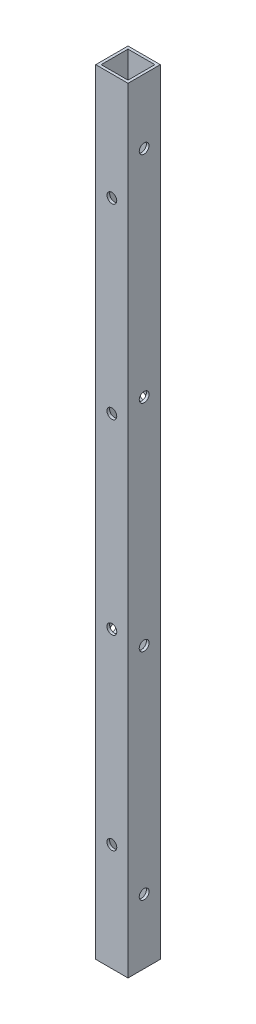
ISO-10303-21;
HEADER;
FILE_DESCRIPTION(('STEP AP214'),'2;1');
FILE_NAME('part.step','',(''),(''),'','','');
FILE_SCHEMA(('AUTOMOTIVE_DESIGN { 1 0 10303 214 1 1 1 1 }'));
ENDSEC;
DATA;
#1=APPLICATION_CONTEXT('core data for automotive mechanical design processes');
#2=APPLICATION_PROTOCOL_DEFINITION('international standard','automotive_design',2000,#1);
#3=PRODUCT_CONTEXT('',#1,'mechanical');
#4=PRODUCT('Part','Part','',(#3));
#5=PRODUCT_RELATED_PRODUCT_CATEGORY('part','',(#4));
#6=PRODUCT_DEFINITION_FORMATION('','',#4);
#7=PRODUCT_DEFINITION_CONTEXT('part definition',#1,'design');
#8=PRODUCT_DEFINITION('design','',#6,#7);
#9=PRODUCT_DEFINITION_SHAPE('','',#8);
#10=(LENGTH_UNIT() NAMED_UNIT(*) SI_UNIT(.MILLI.,.METRE.));
#11=(NAMED_UNIT(*) PLANE_ANGLE_UNIT() SI_UNIT($,.RADIAN.));
#12=(NAMED_UNIT(*) SI_UNIT($,.STERADIAN.) SOLID_ANGLE_UNIT());
#13=UNCERTAINTY_MEASURE_WITH_UNIT(LENGTH_MEASURE(1.E-05),#10,'distance_accuracy_value','');
#14=(GEOMETRIC_REPRESENTATION_CONTEXT(3) GLOBAL_UNCERTAINTY_ASSIGNED_CONTEXT((#13)) GLOBAL_UNIT_ASSIGNED_CONTEXT((#10,
#11,#12)) REPRESENTATION_CONTEXT('',''));
#15=CARTESIAN_POINT('',(0.,0.,0.));
#16=DIRECTION('',(0.,0.,1.));
#17=DIRECTION('',(1.,0.,0.));
#18=AXIS2_PLACEMENT_3D('',#15,#16,#17);
#19=CARTESIAN_POINT('',(9.52500000000001,38.0999999999999,0.));
#20=DIRECTION('',(-1.,0.,0.));
#21=DIRECTION('',(0.,0.,1.));
#22=AXIS2_PLACEMENT_3D('',#19,#20,#21);
#23=CYLINDRICAL_SURFACE('',#22,2.8956);
#24=CARTESIAN_POINT('',(-7.9375,38.0999999999999,0.));
#25=DIRECTION('',(1.,0.,0.));
#26=DIRECTION('',(0.,0.,-1.));
#27=AXIS2_PLACEMENT_3D('',#24,#25,#26);
#28=CIRCLE('',#27,2.8956);
#29=CARTESIAN_POINT('',(-7.9375,38.0999999999999,-2.8956));
#30=VERTEX_POINT('',#29);
#31=EDGE_CURVE('E40',#30,#30,#28,.T.);
#32=ORIENTED_EDGE('',*,*,#31,.T.);
#33=EDGE_LOOP('',(#32));
#34=FACE_BOUND('',#33,.T.);
#35=CARTESIAN_POINT('',(-9.525,38.0999999999999,0.));
#36=DIRECTION('',(-1.,0.,0.));
#37=DIRECTION('',(0.,0.,1.));
#38=AXIS2_PLACEMENT_3D('',#35,#36,#37);
#39=CIRCLE('',#38,2.8956);
#40=CARTESIAN_POINT('',(-9.525,38.0999999999999,2.89560000000001));
#41=VERTEX_POINT('',#40);
#42=EDGE_CURVE('E11',#41,#41,#39,.T.);
#43=ORIENTED_EDGE('',*,*,#42,.T.);
#44=EDGE_LOOP('',(#43));
#45=FACE_BOUND('',#44,.T.);
#46=ADVANCED_FACE('F33',(#34,#45),#23,.F.);
#47=CARTESIAN_POINT('',(9.52500000000001,165.167733333333,0.));
#48=DIRECTION('',(-1.,0.,0.));
#49=DIRECTION('',(0.,0.,1.));
#50=AXIS2_PLACEMENT_3D('',#47,#48,#49);
#51=CYLINDRICAL_SURFACE('',#50,2.8956);
#52=CARTESIAN_POINT('',(-7.9375,165.167733333333,0.));
#53=DIRECTION('',(1.,0.,0.));
#54=DIRECTION('',(0.,0.,-1.));
#55=AXIS2_PLACEMENT_3D('',#52,#53,#54);
#56=CIRCLE('',#55,2.8956);
#57=CARTESIAN_POINT('',(-7.9375,165.167733333333,-2.8956));
#58=VERTEX_POINT('',#57);
#59=EDGE_CURVE('E212',#58,#58,#56,.T.);
#60=ORIENTED_EDGE('',*,*,#59,.T.);
#61=EDGE_LOOP('',(#60));
#62=FACE_BOUND('',#61,.T.);
#63=CARTESIAN_POINT('',(-9.525,165.167733333333,0.));
#64=DIRECTION('',(-1.,0.,0.));
#65=DIRECTION('',(0.,0.,1.));
#66=AXIS2_PLACEMENT_3D('',#63,#64,#65);
#67=CIRCLE('',#66,2.8956);
#68=CARTESIAN_POINT('',(-9.525,165.167733333333,2.89560000000001));
#69=VERTEX_POINT('',#68);
#70=EDGE_CURVE('E215',#69,#69,#67,.T.);
#71=ORIENTED_EDGE('',*,*,#70,.T.);
#72=EDGE_LOOP('',(#71));
#73=FACE_BOUND('',#72,.T.);
#74=ADVANCED_FACE('F239',(#62,#73),#51,.F.);
#75=CARTESIAN_POINT('',(9.52500000000001,38.0999999999999,0.));
#76=DIRECTION('',(-1.,0.,0.));
#77=DIRECTION('',(0.,0.,1.));
#78=AXIS2_PLACEMENT_3D('',#75,#76,#77);
#79=CYLINDRICAL_SURFACE('',#78,2.8956);
#80=CARTESIAN_POINT('',(7.9375,38.0999999999999,0.));
#81=DIRECTION('',(-1.,0.,0.));
#82=DIRECTION('',(0.,0.,1.));
#83=AXIS2_PLACEMENT_3D('',#80,#81,#82);
#84=CIRCLE('',#83,2.8956);
#85=CARTESIAN_POINT('',(7.9375,38.0999999999999,2.8956));
#86=VERTEX_POINT('',#85);
#87=EDGE_CURVE('E206',#86,#86,#84,.T.);
#88=ORIENTED_EDGE('',*,*,#87,.T.);
#89=EDGE_LOOP('',(#88));
#90=FACE_BOUND('',#89,.T.);
#91=CARTESIAN_POINT('',(9.52500000000001,38.0999999999999,0.));
#92=DIRECTION('',(-1.,0.,0.));
#93=DIRECTION('',(0.,0.,1.));
#94=AXIS2_PLACEMENT_3D('',#91,#92,#93);
#95=CIRCLE('',#94,2.8956);
#96=CARTESIAN_POINT('',(9.52500000000001,38.0999999999999,2.8956));
#97=VERTEX_POINT('',#96);
#98=EDGE_CURVE('E209',#97,#97,#95,.T.);
#99=ORIENTED_EDGE('',*,*,#98,.F.);
#100=EDGE_LOOP('',(#99));
#101=FACE_BOUND('',#100,.T.);
#102=ADVANCED_FACE('F243',(#90,#101),#79,.F.);
#103=CARTESIAN_POINT('',(9.52500000000001,165.167733333333,0.));
#104=DIRECTION('',(-1.,0.,0.));
#105=DIRECTION('',(0.,0.,1.));
#106=AXIS2_PLACEMENT_3D('',#103,#104,#105);
#107=CYLINDRICAL_SURFACE('',#106,2.8956);
#108=CARTESIAN_POINT('',(7.9375,165.167733333333,0.));
#109=DIRECTION('',(-1.,0.,0.));
#110=DIRECTION('',(0.,0.,1.));
#111=AXIS2_PLACEMENT_3D('',#108,#109,#110);
#112=CIRCLE('',#111,2.8956);
#113=CARTESIAN_POINT('',(7.9375,165.167733333333,2.8956));
#114=VERTEX_POINT('',#113);
#115=EDGE_CURVE('E195',#114,#114,#112,.T.);
#116=ORIENTED_EDGE('',*,*,#115,.T.);
#117=EDGE_LOOP('',(#116));
#118=FACE_BOUND('',#117,.T.);
#119=CARTESIAN_POINT('',(9.52500000000001,165.167733333333,0.));
#120=DIRECTION('',(-1.,0.,0.));
#121=DIRECTION('',(0.,0.,1.));
#122=AXIS2_PLACEMENT_3D('',#119,#120,#121);
#123=CIRCLE('',#122,2.8956);
#124=CARTESIAN_POINT('',(9.52500000000001,165.167733333333,2.8956));
#125=VERTEX_POINT('',#124);
#126=EDGE_CURVE('E203',#125,#125,#123,.T.);
#127=ORIENTED_EDGE('',*,*,#126,.F.);
#128=EDGE_LOOP('',(#127));
#129=FACE_BOUND('',#128,.T.);
#130=ADVANCED_FACE('F248',(#118,#129),#107,.F.);
#131=CARTESIAN_POINT('',(0.,63.3984,-9.525));
#132=DIRECTION('',(0.,0.,1.));
#133=DIRECTION('',(1.,0.,0.));
#134=AXIS2_PLACEMENT_3D('',#131,#132,#133);
#135=CYLINDRICAL_SURFACE('',#134,2.8956);
#136=CARTESIAN_POINT('',(0.,63.3984,7.9375));
#137=DIRECTION('',(0.,0.,-1.));
#138=DIRECTION('',(-1.,0.,0.));
#139=AXIS2_PLACEMENT_3D('',#136,#137,#138);
#140=CIRCLE('',#139,2.8956);
#141=CARTESIAN_POINT('',(-2.8956,63.3984,7.9375));
#142=VERTEX_POINT('',#141);
#143=EDGE_CURVE('E189',#142,#142,#140,.T.);
#144=ORIENTED_EDGE('',*,*,#143,.T.);
#145=EDGE_LOOP('',(#144));
#146=FACE_BOUND('',#145,.T.);
#147=CARTESIAN_POINT('',(0.,63.3984,9.525));
#148=DIRECTION('',(0.,0.,1.));
#149=DIRECTION('',(1.,0.,0.));
#150=AXIS2_PLACEMENT_3D('',#147,#148,#149);
#151=CIRCLE('',#150,2.8956);
#152=CARTESIAN_POINT('',(2.8956,63.3984,9.525));
#153=VERTEX_POINT('',#152);
#154=EDGE_CURVE('E192',#153,#153,#151,.T.);
#155=ORIENTED_EDGE('',*,*,#154,.T.);
#156=EDGE_LOOP('',(#155));
#157=FACE_BOUND('',#156,.T.);
#158=ADVANCED_FACE('F255',(#146,#157),#135,.F.);
#159=CARTESIAN_POINT('',(0.,173.600533333333,-9.525));
#160=DIRECTION('',(0.,0.,1.));
#161=DIRECTION('',(1.,0.,0.));
#162=AXIS2_PLACEMENT_3D('',#159,#160,#161);
#163=CYLINDRICAL_SURFACE('',#162,2.8956);
#164=CARTESIAN_POINT('',(0.,173.600533333333,7.9375));
#165=DIRECTION('',(0.,0.,-1.));
#166=DIRECTION('',(-1.,0.,0.));
#167=AXIS2_PLACEMENT_3D('',#164,#165,#166);
#168=CIRCLE('',#167,2.8956);
#169=CARTESIAN_POINT('',(-2.8956,173.600533333333,7.9375));
#170=VERTEX_POINT('',#169);
#171=EDGE_CURVE('E183',#170,#170,#168,.T.);
#172=ORIENTED_EDGE('',*,*,#171,.T.);
#173=EDGE_LOOP('',(#172));
#174=FACE_BOUND('',#173,.T.);
#175=CARTESIAN_POINT('',(0.,173.600533333333,9.525));
#176=DIRECTION('',(0.,0.,1.));
#177=DIRECTION('',(1.,0.,0.));
#178=AXIS2_PLACEMENT_3D('',#175,#176,#177);
#179=CIRCLE('',#178,2.8956);
#180=CARTESIAN_POINT('',(2.8956,173.600533333333,9.525));
#181=VERTEX_POINT('',#180);
#182=EDGE_CURVE('E186',#181,#181,#179,.T.);
#183=ORIENTED_EDGE('',*,*,#182,.T.);
#184=EDGE_LOOP('',(#183));
#185=FACE_BOUND('',#184,.T.);
#186=ADVANCED_FACE('F259',(#174,#185),#163,.F.);
#187=CARTESIAN_POINT('',(0.,63.3984,-9.525));
#188=DIRECTION('',(0.,0.,1.));
#189=DIRECTION('',(1.,0.,0.));
#190=AXIS2_PLACEMENT_3D('',#187,#188,#189);
#191=CYLINDRICAL_SURFACE('',#190,2.8956);
#192=CARTESIAN_POINT('',(0.,63.3984,-7.9375));
#193=DIRECTION('',(0.,0.,1.));
#194=DIRECTION('',(1.,0.,0.));
#195=AXIS2_PLACEMENT_3D('',#192,#193,#194);
#196=CIRCLE('',#195,2.8956);
#197=CARTESIAN_POINT('',(2.8956,63.3984,-7.9375));
#198=VERTEX_POINT('',#197);
#199=EDGE_CURVE('E177',#198,#198,#196,.T.);
#200=ORIENTED_EDGE('',*,*,#199,.T.);
#201=EDGE_LOOP('',(#200));
#202=FACE_BOUND('',#201,.T.);
#203=CARTESIAN_POINT('',(0.,63.3984,-9.525));
#204=DIRECTION('',(0.,0.,1.));
#205=DIRECTION('',(1.,0.,0.));
#206=AXIS2_PLACEMENT_3D('',#203,#204,#205);
#207=CIRCLE('',#206,2.8956);
#208=CARTESIAN_POINT('',(2.8956,63.3984,-9.525));
#209=VERTEX_POINT('',#208);
#210=EDGE_CURVE('E180',#209,#209,#207,.T.);
#211=ORIENTED_EDGE('',*,*,#210,.F.);
#212=EDGE_LOOP('',(#211));
#213=FACE_BOUND('',#212,.T.);
#214=ADVANCED_FACE('F263',(#202,#213),#191,.F.);
#215=CARTESIAN_POINT('',(0.,173.600533333333,-9.525));
#216=DIRECTION('',(0.,0.,1.));
#217=DIRECTION('',(1.,0.,0.));
#218=AXIS2_PLACEMENT_3D('',#215,#216,#217);
#219=CYLINDRICAL_SURFACE('',#218,2.8956);
#220=CARTESIAN_POINT('',(0.,173.600533333333,-7.9375));
#221=DIRECTION('',(0.,0.,1.));
#222=DIRECTION('',(1.,0.,0.));
#223=AXIS2_PLACEMENT_3D('',#220,#221,#222);
#224=CIRCLE('',#223,2.8956);
#225=CARTESIAN_POINT('',(2.8956,173.600533333333,-7.9375));
#226=VERTEX_POINT('',#225);
#227=EDGE_CURVE('E167',#226,#226,#224,.T.);
#228=ORIENTED_EDGE('',*,*,#227,.T.);
#229=EDGE_LOOP('',(#228));
#230=FACE_BOUND('',#229,.T.);
#231=CARTESIAN_POINT('',(0.,173.600533333333,-9.525));
#232=DIRECTION('',(0.,0.,1.));
#233=DIRECTION('',(1.,0.,0.));
#234=AXIS2_PLACEMENT_3D('',#231,#232,#233);
#235=CIRCLE('',#234,2.8956);
#236=CARTESIAN_POINT('',(2.8956,173.600533333333,-9.525));
#237=VERTEX_POINT('',#236);
#238=EDGE_CURVE('E174',#237,#237,#235,.T.);
#239=ORIENTED_EDGE('',*,*,#238,.F.);
#240=EDGE_LOOP('',(#239));
#241=FACE_BOUND('',#240,.T.);
#242=ADVANCED_FACE('F267',(#230,#241),#219,.F.);
#243=CARTESIAN_POINT('',(0.,457.4032,0.));
#244=DIRECTION('',(0.,1.,0.));
#245=DIRECTION('',(0.,0.,1.));
#246=AXIS2_PLACEMENT_3D('',#243,#244,#245);
#247=PLANE('',#246);
#248=DIRECTION('',(0.,0.,-1.));
#249=VECTOR('',#248,1.);
#250=CARTESIAN_POINT('',(9.525,457.4032,-9.525));
#251=LINE('',#250,#249);
#252=CARTESIAN_POINT('',(9.525,457.4032,9.525));
#253=VERTEX_POINT('',#252);
#254=CARTESIAN_POINT('',(9.525,457.4032,-9.525));
#255=VERTEX_POINT('',#254);
#256=EDGE_CURVE('E138',#253,#255,#251,.T.);
#257=ORIENTED_EDGE('',*,*,#256,.T.);
#258=DIRECTION('',(-1.,0.,0.));
#259=VECTOR('',#258,1.);
#260=CARTESIAN_POINT('',(-9.525,457.4032,-9.525));
#261=LINE('',#260,#259);
#262=CARTESIAN_POINT('',(-9.525,457.4032,-9.525));
#263=VERTEX_POINT('',#262);
#264=EDGE_CURVE('E141',#255,#263,#261,.T.);
#265=ORIENTED_EDGE('',*,*,#264,.T.);
#266=DIRECTION('',(0.,0.,1.));
#267=VECTOR('',#266,1.);
#268=CARTESIAN_POINT('',(-9.525,457.4032,-9.525));
#269=LINE('',#268,#267);
#270=CARTESIAN_POINT('',(-9.525,457.4032,9.525));
#271=VERTEX_POINT('',#270);
#272=EDGE_CURVE('E144',#263,#271,#269,.T.);
#273=ORIENTED_EDGE('',*,*,#272,.T.);
#274=DIRECTION('',(1.,0.,0.));
#275=VECTOR('',#274,1.);
#276=CARTESIAN_POINT('',(-9.525,457.4032,9.525));
#277=LINE('',#276,#275);
#278=EDGE_CURVE('E146',#271,#253,#277,.T.);
#279=ORIENTED_EDGE('',*,*,#278,.T.);
#280=EDGE_LOOP('',(#257,#265,#273,#279));
#281=FACE_BOUND('',#280,.T.);
#282=DIRECTION('',(-1.,0.,0.));
#283=VECTOR('',#282,1.);
#284=CARTESIAN_POINT('',(-7.9375,457.4032,-7.9375));
#285=LINE('',#284,#283);
#286=CARTESIAN_POINT('',(7.9375,457.4032,-7.9375));
#287=VERTEX_POINT('',#286);
#288=CARTESIAN_POINT('',(-7.9375,457.4032,-7.9375));
#289=VERTEX_POINT('',#288);
#290=EDGE_CURVE('E106',#287,#289,#285,.T.);
#291=ORIENTED_EDGE('',*,*,#290,.F.);
#292=DIRECTION('',(0.,0.,-1.));
#293=VECTOR('',#292,1.);
#294=CARTESIAN_POINT('',(7.9375,457.4032,-7.9375));
#295=LINE('',#294,#293);
#296=CARTESIAN_POINT('',(7.9375,457.4032,7.9375));
#297=VERTEX_POINT('',#296);
#298=EDGE_CURVE('E97',#297,#287,#295,.T.);
#299=ORIENTED_EDGE('',*,*,#298,.F.);
#300=DIRECTION('',(1.,0.,0.));
#301=VECTOR('',#300,1.);
#302=CARTESIAN_POINT('',(-7.9375,457.4032,7.9375));
#303=LINE('',#302,#301);
#304=CARTESIAN_POINT('',(-7.9375,457.4032,7.9375));
#305=VERTEX_POINT('',#304);
#306=EDGE_CURVE('E122',#305,#297,#303,.T.);
#307=ORIENTED_EDGE('',*,*,#306,.F.);
#308=DIRECTION('',(0.,0.,1.));
#309=VECTOR('',#308,1.);
#310=CARTESIAN_POINT('',(-7.9375,457.4032,-7.9375));
#311=LINE('',#310,#309);
#312=EDGE_CURVE('E120',#289,#305,#311,.T.);
#313=ORIENTED_EDGE('',*,*,#312,.F.);
#314=EDGE_LOOP('',(#291,#299,#307,#313));
#315=FACE_BOUND('',#314,.T.);
#316=ADVANCED_FACE('F119',(#281,#315),#247,.T.);
#317=CARTESIAN_POINT('',(0.,0.,0.));
#318=DIRECTION('',(0.,1.,0.));
#319=DIRECTION('',(0.,0.,1.));
#320=AXIS2_PLACEMENT_3D('',#317,#318,#319);
#321=PLANE('',#320);
#322=DIRECTION('',(0.,0.,-1.));
#323=VECTOR('',#322,1.);
#324=CARTESIAN_POINT('',(9.525,0.,-9.525));
#325=LINE('',#324,#323);
#326=CARTESIAN_POINT('',(9.525,0.,9.525));
#327=VERTEX_POINT('',#326);
#328=CARTESIAN_POINT('',(9.525,0.,-9.525));
#329=VERTEX_POINT('',#328);
#330=EDGE_CURVE('E115',#327,#329,#325,.T.);
#331=ORIENTED_EDGE('',*,*,#330,.F.);
#332=DIRECTION('',(1.,0.,0.));
#333=VECTOR('',#332,1.);
#334=CARTESIAN_POINT('',(-9.525,0.,9.525));
#335=LINE('',#334,#333);
#336=CARTESIAN_POINT('',(-9.525,0.,9.525));
#337=VERTEX_POINT('',#336);
#338=EDGE_CURVE('E142',#337,#327,#335,.T.);
#339=ORIENTED_EDGE('',*,*,#338,.F.);
#340=DIRECTION('',(0.,0.,1.));
#341=VECTOR('',#340,1.);
#342=CARTESIAN_POINT('',(-9.525,0.,-9.525));
#343=LINE('',#342,#341);
#344=CARTESIAN_POINT('',(-9.525,0.,-9.525));
#345=VERTEX_POINT('',#344);
#346=EDGE_CURVE('E153',#345,#337,#343,.T.);
#347=ORIENTED_EDGE('',*,*,#346,.F.);
#348=DIRECTION('',(-1.,0.,0.));
#349=VECTOR('',#348,1.);
#350=CARTESIAN_POINT('',(-9.525,0.,-9.525));
#351=LINE('',#350,#349);
#352=EDGE_CURVE('E151',#329,#345,#351,.T.);
#353=ORIENTED_EDGE('',*,*,#352,.F.);
#354=EDGE_LOOP('',(#331,#339,#347,#353));
#355=FACE_BOUND('',#354,.T.);
#356=DIRECTION('',(0.,0.,-1.));
#357=VECTOR('',#356,1.);
#358=CARTESIAN_POINT('',(7.9375,0.,-7.9375));
#359=LINE('',#358,#357);
#360=CARTESIAN_POINT('',(7.9375,0.,7.9375));
#361=VERTEX_POINT('',#360);
#362=CARTESIAN_POINT('',(7.9375,0.,-7.9375));
#363=VERTEX_POINT('',#362);
#364=EDGE_CURVE('E55',#361,#363,#359,.T.);
#365=ORIENTED_EDGE('',*,*,#364,.T.);
#366=DIRECTION('',(-1.,0.,0.));
#367=VECTOR('',#366,1.);
#368=CARTESIAN_POINT('',(-7.9375,0.,-7.9375));
#369=LINE('',#368,#367);
#370=CARTESIAN_POINT('',(-7.9375,0.,-7.9375));
#371=VERTEX_POINT('',#370);
#372=EDGE_CURVE('E114',#363,#371,#369,.T.);
#373=ORIENTED_EDGE('',*,*,#372,.T.);
#374=DIRECTION('',(0.,0.,1.));
#375=VECTOR('',#374,1.);
#376=CARTESIAN_POINT('',(-7.9375,0.,-7.9375));
#377=LINE('',#376,#375);
#378=CARTESIAN_POINT('',(-7.9375,0.,7.9375));
#379=VERTEX_POINT('',#378);
#380=EDGE_CURVE('E130',#371,#379,#377,.T.);
#381=ORIENTED_EDGE('',*,*,#380,.T.);
#382=DIRECTION('',(1.,0.,0.));
#383=VECTOR('',#382,1.);
#384=CARTESIAN_POINT('',(-7.9375,0.,7.9375));
#385=LINE('',#384,#383);
#386=EDGE_CURVE('E107',#379,#361,#385,.T.);
#387=ORIENTED_EDGE('',*,*,#386,.T.);
#388=EDGE_LOOP('',(#365,#373,#381,#387));
#389=FACE_BOUND('',#388,.T.);
#390=ADVANCED_FACE('F276',(#355,#389),#321,.F.);
#391=CARTESIAN_POINT('',(9.525,457.4032,-9.525));
#392=DIRECTION('',(-1.,0.,0.));
#393=DIRECTION('',(0.,0.,1.));
#394=AXIS2_PLACEMENT_3D('',#391,#392,#393);
#395=PLANE('',#394);
#396=CARTESIAN_POINT('',(9.52500000000001,292.235466666667,0.));
#397=DIRECTION('',(-1.,0.,0.));
#398=DIRECTION('',(0.,0.,1.));
#399=AXIS2_PLACEMENT_3D('',#396,#397,#398);
#400=CIRCLE('',#399,2.8956);
#401=CARTESIAN_POINT('',(9.52500000000001,292.235466666667,2.8956));
#402=VERTEX_POINT('',#401);
#403=EDGE_CURVE('E416',#402,#402,#400,.T.);
#404=ORIENTED_EDGE('',*,*,#403,.T.);
#405=EDGE_LOOP('',(#404));
#406=FACE_BOUND('',#405,.T.);
#407=CARTESIAN_POINT('',(9.52500000000001,419.3032,0.));
#408=DIRECTION('',(-1.,0.,0.));
#409=DIRECTION('',(0.,0.,1.));
#410=AXIS2_PLACEMENT_3D('',#407,#408,#409);
#411=CIRCLE('',#410,2.8956);
#412=CARTESIAN_POINT('',(9.52500000000001,419.3032,2.8956));
#413=VERTEX_POINT('',#412);
#414=EDGE_CURVE('E200',#413,#413,#411,.T.);
#415=ORIENTED_EDGE('',*,*,#414,.T.);
#416=EDGE_LOOP('',(#415));
#417=FACE_BOUND('',#416,.T.);
#418=ORIENTED_EDGE('',*,*,#330,.T.);
#419=DIRECTION('',(0.,-1.,0.));
#420=VECTOR('',#419,1.);
#421=CARTESIAN_POINT('',(9.525,457.4032,-9.525));
#422=LINE('',#421,#420);
#423=EDGE_CURVE('E164',#255,#329,#422,.T.);
#424=ORIENTED_EDGE('',*,*,#423,.F.);
#425=ORIENTED_EDGE('',*,*,#256,.F.);
#426=DIRECTION('',(0.,-1.,0.));
#427=VECTOR('',#426,1.);
#428=CARTESIAN_POINT('',(9.525,457.4032,9.525));
#429=LINE('',#428,#427);
#430=EDGE_CURVE('E148',#253,#327,#429,.T.);
#431=ORIENTED_EDGE('',*,*,#430,.T.);
#432=EDGE_LOOP('',(#418,#424,#425,#431));
#433=FACE_BOUND('',#432,.T.);
#434=ORIENTED_EDGE('',*,*,#126,.T.);
#435=EDGE_LOOP('',(#434));
#436=FACE_BOUND('',#435,.T.);
#437=ORIENTED_EDGE('',*,*,#98,.T.);
#438=EDGE_LOOP('',(#437));
#439=FACE_BOUND('',#438,.T.);
#440=ADVANCED_FACE('F272',(#406,#417,#433,#436,#439),#395,.F.);
#441=CARTESIAN_POINT('',(-9.525,457.4032,-9.525));
#442=DIRECTION('',(0.,0.,1.));
#443=DIRECTION('',(1.,0.,0.));
#444=AXIS2_PLACEMENT_3D('',#441,#442,#443);
#445=PLANE('',#444);
#446=CARTESIAN_POINT('',(0.,283.802666666667,-9.525));
#447=DIRECTION('',(0.,0.,1.));
#448=DIRECTION('',(1.,0.,0.));
#449=AXIS2_PLACEMENT_3D('',#446,#447,#448);
#450=CIRCLE('',#449,2.8956);
#451=CARTESIAN_POINT('',(2.8956,283.802666666667,-9.525));
#452=VERTEX_POINT('',#451);
#453=EDGE_CURVE('E320',#452,#452,#450,.T.);
#454=ORIENTED_EDGE('',*,*,#453,.T.);
#455=EDGE_LOOP('',(#454));
#456=FACE_BOUND('',#455,.T.);
#457=CARTESIAN_POINT('',(0.,394.0048,-9.525));
#458=DIRECTION('',(0.,0.,1.));
#459=DIRECTION('',(1.,0.,0.));
#460=AXIS2_PLACEMENT_3D('',#457,#458,#459);
#461=CIRCLE('',#460,2.8956);
#462=CARTESIAN_POINT('',(2.8956,394.0048,-9.525));
#463=VERTEX_POINT('',#462);
#464=EDGE_CURVE('E171',#463,#463,#461,.T.);
#465=ORIENTED_EDGE('',*,*,#464,.T.);
#466=EDGE_LOOP('',(#465));
#467=FACE_BOUND('',#466,.T.);
#468=ORIENTED_EDGE('',*,*,#352,.T.);
#469=DIRECTION('',(0.,-1.,0.));
#470=VECTOR('',#469,1.);
#471=CARTESIAN_POINT('',(-9.525,457.4032,-9.525));
#472=LINE('',#471,#470);
#473=EDGE_CURVE('E161',#263,#345,#472,.T.);
#474=ORIENTED_EDGE('',*,*,#473,.F.);
#475=ORIENTED_EDGE('',*,*,#264,.F.);
#476=ORIENTED_EDGE('',*,*,#423,.T.);
#477=EDGE_LOOP('',(#468,#474,#475,#476));
#478=FACE_BOUND('',#477,.T.);
#479=ORIENTED_EDGE('',*,*,#238,.T.);
#480=EDGE_LOOP('',(#479));
#481=FACE_BOUND('',#480,.T.);
#482=ORIENTED_EDGE('',*,*,#210,.T.);
#483=EDGE_LOOP('',(#482));
#484=FACE_BOUND('',#483,.T.);
#485=ADVANCED_FACE('F275',(#456,#467,#478,#481,#484),#445,.F.);
#486=CARTESIAN_POINT('',(-9.525,457.4032,-9.525));
#487=DIRECTION('',(1.,0.,0.));
#488=DIRECTION('',(0.,0.,-1.));
#489=AXIS2_PLACEMENT_3D('',#486,#487,#488);
#490=PLANE('',#489);
#491=CARTESIAN_POINT('',(-9.525,292.235466666667,0.));
#492=DIRECTION('',(-1.,0.,0.));
#493=DIRECTION('',(0.,0.,1.));
#494=AXIS2_PLACEMENT_3D('',#491,#492,#493);
#495=CIRCLE('',#494,2.8956);
#496=CARTESIAN_POINT('',(-9.525,292.235466666667,2.89560000000001));
#497=VERTEX_POINT('',#496);
#498=EDGE_CURVE('E414',#497,#497,#495,.T.);
#499=ORIENTED_EDGE('',*,*,#498,.F.);
#500=EDGE_LOOP('',(#499));
#501=FACE_BOUND('',#500,.T.);
#502=CARTESIAN_POINT('',(-9.525,419.3032,0.));
#503=DIRECTION('',(-1.,0.,0.));
#504=DIRECTION('',(0.,0.,1.));
#505=AXIS2_PLACEMENT_3D('',#502,#503,#504);
#506=CIRCLE('',#505,2.8956);
#507=CARTESIAN_POINT('',(-9.525,419.3032,2.89560000000001));
#508=VERTEX_POINT('',#507);
#509=EDGE_CURVE('E312',#508,#508,#506,.T.);
#510=ORIENTED_EDGE('',*,*,#509,.F.);
#511=EDGE_LOOP('',(#510));
#512=FACE_BOUND('',#511,.T.);
#513=ORIENTED_EDGE('',*,*,#346,.T.);
#514=DIRECTION('',(0.,-1.,0.));
#515=VECTOR('',#514,1.);
#516=CARTESIAN_POINT('',(-9.525,457.4032,9.525));
#517=LINE('',#516,#515);
#518=EDGE_CURVE('E158',#271,#337,#517,.T.);
#519=ORIENTED_EDGE('',*,*,#518,.F.);
#520=ORIENTED_EDGE('',*,*,#272,.F.);
#521=ORIENTED_EDGE('',*,*,#473,.T.);
#522=EDGE_LOOP('',(#513,#519,#520,#521));
#523=FACE_BOUND('',#522,.T.);
#524=ORIENTED_EDGE('',*,*,#70,.F.);
#525=EDGE_LOOP('',(#524));
#526=FACE_BOUND('',#525,.T.);
#527=ORIENTED_EDGE('',*,*,#42,.F.);
#528=EDGE_LOOP('',(#527));
#529=FACE_BOUND('',#528,.T.);
#530=ADVANCED_FACE('F280',(#501,#512,#523,#526,#529),#490,.F.);
#531=CARTESIAN_POINT('',(-9.525,457.4032,9.525));
#532=DIRECTION('',(0.,0.,-1.));
#533=DIRECTION('',(-1.,0.,0.));
#534=AXIS2_PLACEMENT_3D('',#531,#532,#533);
#535=PLANE('',#534);
#536=CARTESIAN_POINT('',(0.,283.802666666667,9.525));
#537=DIRECTION('',(0.,0.,1.));
#538=DIRECTION('',(1.,0.,0.));
#539=AXIS2_PLACEMENT_3D('',#536,#537,#538);
#540=CIRCLE('',#539,2.8956);
#541=CARTESIAN_POINT('',(2.8956,283.802666666667,9.525));
#542=VERTEX_POINT('',#541);
#543=EDGE_CURVE('E309',#542,#542,#540,.T.);
#544=ORIENTED_EDGE('',*,*,#543,.F.);
#545=EDGE_LOOP('',(#544));
#546=FACE_BOUND('',#545,.T.);
#547=CARTESIAN_POINT('',(0.,394.0048,9.525));
#548=DIRECTION('',(0.,0.,1.));
#549=DIRECTION('',(1.,0.,0.));
#550=AXIS2_PLACEMENT_3D('',#547,#548,#549);
#551=CIRCLE('',#550,2.8956);
#552=CARTESIAN_POINT('',(2.8956,394.0048,9.525));
#553=VERTEX_POINT('',#552);
#554=EDGE_CURVE('E323',#553,#553,#551,.T.);
#555=ORIENTED_EDGE('',*,*,#554,.F.);
#556=EDGE_LOOP('',(#555));
#557=FACE_BOUND('',#556,.T.);
#558=ORIENTED_EDGE('',*,*,#338,.T.);
#559=ORIENTED_EDGE('',*,*,#430,.F.);
#560=ORIENTED_EDGE('',*,*,#278,.F.);
#561=ORIENTED_EDGE('',*,*,#518,.T.);
#562=EDGE_LOOP('',(#558,#559,#560,#561));
#563=FACE_BOUND('',#562,.T.);
#564=ORIENTED_EDGE('',*,*,#182,.F.);
#565=EDGE_LOOP('',(#564));
#566=FACE_BOUND('',#565,.T.);
#567=ORIENTED_EDGE('',*,*,#154,.F.);
#568=EDGE_LOOP('',(#567));
#569=FACE_BOUND('',#568,.T.);
#570=ADVANCED_FACE('F284',(#546,#557,#563,#566,#569),#535,.F.);
#571=CARTESIAN_POINT('',(7.9375,457.4032,-7.9375));
#572=DIRECTION('',(-1.,0.,0.));
#573=DIRECTION('',(0.,0.,1.));
#574=AXIS2_PLACEMENT_3D('',#571,#572,#573);
#575=PLANE('',#574);
#576=CARTESIAN_POINT('',(7.9375,292.235466666667,0.));
#577=DIRECTION('',(-1.,0.,0.));
#578=DIRECTION('',(0.,0.,1.));
#579=AXIS2_PLACEMENT_3D('',#576,#577,#578);
#580=CIRCLE('',#579,2.8956);
#581=CARTESIAN_POINT('',(7.9375,292.235466666667,2.8956));
#582=VERTEX_POINT('',#581);
#583=EDGE_CURVE('E302',#582,#582,#580,.T.);
#584=ORIENTED_EDGE('',*,*,#583,.F.);
#585=EDGE_LOOP('',(#584));
#586=FACE_BOUND('',#585,.T.);
#587=CARTESIAN_POINT('',(7.9375,419.3032,0.));
#588=DIRECTION('',(-1.,0.,0.));
#589=DIRECTION('',(0.,0.,1.));
#590=AXIS2_PLACEMENT_3D('',#587,#588,#589);
#591=CIRCLE('',#590,2.8956);
#592=CARTESIAN_POINT('',(7.9375,419.3032,2.8956));
#593=VERTEX_POINT('',#592);
#594=EDGE_CURVE('E199',#593,#593,#591,.T.);
#595=ORIENTED_EDGE('',*,*,#594,.F.);
#596=EDGE_LOOP('',(#595));
#597=FACE_BOUND('',#596,.T.);
#598=ORIENTED_EDGE('',*,*,#364,.F.);
#599=DIRECTION('',(0.,-1.,0.));
#600=VECTOR('',#599,1.);
#601=CARTESIAN_POINT('',(7.9375,457.4032,7.9375));
#602=LINE('',#601,#600);
#603=EDGE_CURVE('E102',#297,#361,#602,.T.);
#604=ORIENTED_EDGE('',*,*,#603,.F.);
#605=ORIENTED_EDGE('',*,*,#298,.T.);
#606=DIRECTION('',(0.,-1.,0.));
#607=VECTOR('',#606,1.);
#608=CARTESIAN_POINT('',(7.9375,457.4032,-7.9375));
#609=LINE('',#608,#607);
#610=EDGE_CURVE('E101',#287,#363,#609,.T.);
#611=ORIENTED_EDGE('',*,*,#610,.T.);
#612=EDGE_LOOP('',(#598,#604,#605,#611));
#613=FACE_BOUND('',#612,.T.);
#614=ORIENTED_EDGE('',*,*,#115,.F.);
#615=EDGE_LOOP('',(#614));
#616=FACE_BOUND('',#615,.T.);
#617=ORIENTED_EDGE('',*,*,#87,.F.);
#618=EDGE_LOOP('',(#617));
#619=FACE_BOUND('',#618,.T.);
#620=ADVANCED_FACE('F99',(#586,#597,#613,#616,#619),#575,.T.);
#621=CARTESIAN_POINT('',(-7.9375,457.4032,-7.9375));
#622=DIRECTION('',(0.,0.,1.));
#623=DIRECTION('',(1.,0.,0.));
#624=AXIS2_PLACEMENT_3D('',#621,#622,#623);
#625=PLANE('',#624);
#626=CARTESIAN_POINT('',(0.,283.802666666667,-7.9375));
#627=DIRECTION('',(0.,0.,1.));
#628=DIRECTION('',(1.,0.,0.));
#629=AXIS2_PLACEMENT_3D('',#626,#627,#628);
#630=CIRCLE('',#629,2.8956);
#631=CARTESIAN_POINT('',(2.8956,283.802666666667,-7.9375));
#632=VERTEX_POINT('',#631);
#633=EDGE_CURVE('E317',#632,#632,#630,.T.);
#634=ORIENTED_EDGE('',*,*,#633,.F.);
#635=EDGE_LOOP('',(#634));
#636=FACE_BOUND('',#635,.T.);
#637=CARTESIAN_POINT('',(0.,394.0048,-7.9375));
#638=DIRECTION('',(0.,0.,1.));
#639=DIRECTION('',(1.,0.,0.));
#640=AXIS2_PLACEMENT_3D('',#637,#638,#639);
#641=CIRCLE('',#640,2.8956);
#642=CARTESIAN_POINT('',(2.8956,394.0048,-7.9375));
#643=VERTEX_POINT('',#642);
#644=EDGE_CURVE('E128',#643,#643,#641,.T.);
#645=ORIENTED_EDGE('',*,*,#644,.F.);
#646=EDGE_LOOP('',(#645));
#647=FACE_BOUND('',#646,.T.);
#648=ORIENTED_EDGE('',*,*,#372,.F.);
#649=ORIENTED_EDGE('',*,*,#610,.F.);
#650=ORIENTED_EDGE('',*,*,#290,.T.);
#651=DIRECTION('',(0.,-1.,0.));
#652=VECTOR('',#651,1.);
#653=CARTESIAN_POINT('',(-7.9375,457.4032,-7.9375));
#654=LINE('',#653,#652);
#655=EDGE_CURVE('E116',#289,#371,#654,.T.);
#656=ORIENTED_EDGE('',*,*,#655,.T.);
#657=EDGE_LOOP('',(#648,#649,#650,#656));
#658=FACE_BOUND('',#657,.T.);
#659=ORIENTED_EDGE('',*,*,#227,.F.);
#660=EDGE_LOOP('',(#659));
#661=FACE_BOUND('',#660,.T.);
#662=ORIENTED_EDGE('',*,*,#199,.F.);
#663=EDGE_LOOP('',(#662));
#664=FACE_BOUND('',#663,.T.);
#665=ADVANCED_FACE('F110',(#636,#647,#658,#661,#664),#625,.T.);
#666=CARTESIAN_POINT('',(-7.9375,457.4032,-7.9375));
#667=DIRECTION('',(1.,0.,0.));
#668=DIRECTION('',(0.,0.,-1.));
#669=AXIS2_PLACEMENT_3D('',#666,#667,#668);
#670=PLANE('',#669);
#671=CARTESIAN_POINT('',(-7.9375,292.235466666667,0.));
#672=DIRECTION('',(1.,0.,0.));
#673=DIRECTION('',(0.,0.,-1.));
#674=AXIS2_PLACEMENT_3D('',#671,#672,#673);
#675=CIRCLE('',#674,2.8956);
#676=CARTESIAN_POINT('',(-7.9375,292.235466666667,-2.8956));
#677=VERTEX_POINT('',#676);
#678=EDGE_CURVE('E411',#677,#677,#675,.T.);
#679=ORIENTED_EDGE('',*,*,#678,.F.);
#680=EDGE_LOOP('',(#679));
#681=FACE_BOUND('',#680,.T.);
#682=CARTESIAN_POINT('',(-7.9375,419.3032,0.));
#683=DIRECTION('',(1.,0.,0.));
#684=DIRECTION('',(0.,0.,-1.));
#685=AXIS2_PLACEMENT_3D('',#682,#683,#684);
#686=CIRCLE('',#685,2.8956);
#687=CARTESIAN_POINT('',(-7.9375,419.3032,-2.8956));
#688=VERTEX_POINT('',#687);
#689=EDGE_CURVE('E196',#688,#688,#686,.T.);
#690=ORIENTED_EDGE('',*,*,#689,.F.);
#691=EDGE_LOOP('',(#690));
#692=FACE_BOUND('',#691,.T.);
#693=ORIENTED_EDGE('',*,*,#380,.F.);
#694=ORIENTED_EDGE('',*,*,#655,.F.);
#695=ORIENTED_EDGE('',*,*,#312,.T.);
#696=DIRECTION('',(0.,-1.,0.));
#697=VECTOR('',#696,1.);
#698=CARTESIAN_POINT('',(-7.9375,457.4032,7.9375));
#699=LINE('',#698,#697);
#700=EDGE_CURVE('E47',#305,#379,#699,.T.);
#701=ORIENTED_EDGE('',*,*,#700,.T.);
#702=EDGE_LOOP('',(#693,#694,#695,#701));
#703=FACE_BOUND('',#702,.T.);
#704=ORIENTED_EDGE('',*,*,#59,.F.);
#705=EDGE_LOOP('',(#704));
#706=FACE_BOUND('',#705,.T.);
#707=ORIENTED_EDGE('',*,*,#31,.F.);
#708=EDGE_LOOP('',(#707));
#709=FACE_BOUND('',#708,.T.);
#710=ADVANCED_FACE('F222',(#681,#692,#703,#706,#709),#670,.T.);
#711=CARTESIAN_POINT('',(-7.9375,457.4032,7.9375));
#712=DIRECTION('',(0.,0.,-1.));
#713=DIRECTION('',(-1.,0.,0.));
#714=AXIS2_PLACEMENT_3D('',#711,#712,#713);
#715=PLANE('',#714);
#716=CARTESIAN_POINT('',(0.,283.802666666667,7.9375));
#717=DIRECTION('',(0.,0.,-1.));
#718=DIRECTION('',(-1.,0.,0.));
#719=AXIS2_PLACEMENT_3D('',#716,#717,#718);
#720=CIRCLE('',#719,2.8956);
#721=CARTESIAN_POINT('',(-2.8956,283.802666666667,7.9375));
#722=VERTEX_POINT('',#721);
#723=EDGE_CURVE('E306',#722,#722,#720,.T.);
#724=ORIENTED_EDGE('',*,*,#723,.F.);
#725=EDGE_LOOP('',(#724));
#726=FACE_BOUND('',#725,.T.);
#727=CARTESIAN_POINT('',(0.,394.0048,7.9375));
#728=DIRECTION('',(0.,0.,-1.));
#729=DIRECTION('',(-1.,0.,0.));
#730=AXIS2_PLACEMENT_3D('',#727,#728,#729);
#731=CIRCLE('',#730,2.8956);
#732=CARTESIAN_POINT('',(-2.8956,394.0048,7.9375));
#733=VERTEX_POINT('',#732);
#734=EDGE_CURVE('E168',#733,#733,#731,.T.);
#735=ORIENTED_EDGE('',*,*,#734,.F.);
#736=EDGE_LOOP('',(#735));
#737=FACE_BOUND('',#736,.T.);
#738=ORIENTED_EDGE('',*,*,#386,.F.);
#739=ORIENTED_EDGE('',*,*,#700,.F.);
#740=ORIENTED_EDGE('',*,*,#306,.T.);
#741=ORIENTED_EDGE('',*,*,#603,.T.);
#742=EDGE_LOOP('',(#738,#739,#740,#741));
#743=FACE_BOUND('',#742,.T.);
#744=ORIENTED_EDGE('',*,*,#171,.F.);
#745=EDGE_LOOP('',(#744));
#746=FACE_BOUND('',#745,.T.);
#747=ORIENTED_EDGE('',*,*,#143,.F.);
#748=EDGE_LOOP('',(#747));
#749=FACE_BOUND('',#748,.T.);
#750=ADVANCED_FACE('F224',(#726,#737,#743,#746,#749),#715,.T.);
#751=CARTESIAN_POINT('',(0.,394.0048,-9.525));
#752=DIRECTION('',(0.,0.,1.));
#753=DIRECTION('',(1.,0.,0.));
#754=AXIS2_PLACEMENT_3D('',#751,#752,#753);
#755=CYLINDRICAL_SURFACE('',#754,2.8956);
#756=ORIENTED_EDGE('',*,*,#734,.T.);
#757=EDGE_LOOP('',(#756));
#758=FACE_BOUND('',#757,.T.);
#759=ORIENTED_EDGE('',*,*,#554,.T.);
#760=EDGE_LOOP('',(#759));
#761=FACE_BOUND('',#760,.T.);
#762=ADVANCED_FACE('F231',(#758,#761),#755,.F.);
#763=ORIENTED_EDGE('',*,*,#644,.T.);
#764=EDGE_LOOP('',(#763));
#765=FACE_BOUND('',#764,.T.);
#766=ORIENTED_EDGE('',*,*,#464,.F.);
#767=EDGE_LOOP('',(#766));
#768=FACE_BOUND('',#767,.T.);
#769=ADVANCED_FACE('F330',(#765,#768),#755,.F.);
#770=CARTESIAN_POINT('',(0.,283.802666666667,-9.525));
#771=DIRECTION('',(0.,0.,1.));
#772=DIRECTION('',(1.,0.,0.));
#773=AXIS2_PLACEMENT_3D('',#770,#771,#772);
#774=CYLINDRICAL_SURFACE('',#773,2.8956);
#775=ORIENTED_EDGE('',*,*,#633,.T.);
#776=EDGE_LOOP('',(#775));
#777=FACE_BOUND('',#776,.T.);
#778=ORIENTED_EDGE('',*,*,#453,.F.);
#779=EDGE_LOOP('',(#778));
#780=FACE_BOUND('',#779,.T.);
#781=ADVANCED_FACE('F334',(#777,#780),#774,.F.);
#782=CARTESIAN_POINT('',(0.,283.802666666667,-9.525));
#783=DIRECTION('',(0.,0.,1.));
#784=DIRECTION('',(1.,0.,0.));
#785=AXIS2_PLACEMENT_3D('',#782,#783,#784);
#786=CYLINDRICAL_SURFACE('',#785,2.8956);
#787=ORIENTED_EDGE('',*,*,#723,.T.);
#788=EDGE_LOOP('',(#787));
#789=FACE_BOUND('',#788,.T.);
#790=ORIENTED_EDGE('',*,*,#543,.T.);
#791=EDGE_LOOP('',(#790));
#792=FACE_BOUND('',#791,.T.);
#793=ADVANCED_FACE('F387',(#789,#792),#786,.F.);
#794=CARTESIAN_POINT('',(9.52500000000001,419.3032,0.));
#795=DIRECTION('',(-1.,0.,0.));
#796=DIRECTION('',(0.,0.,1.));
#797=AXIS2_PLACEMENT_3D('',#794,#795,#796);
#798=CYLINDRICAL_SURFACE('',#797,2.8956);
#799=ORIENTED_EDGE('',*,*,#689,.T.);
#800=EDGE_LOOP('',(#799));
#801=FACE_BOUND('',#800,.T.);
#802=ORIENTED_EDGE('',*,*,#509,.T.);
#803=EDGE_LOOP('',(#802));
#804=FACE_BOUND('',#803,.T.);
#805=ADVANCED_FACE('F394',(#801,#804),#798,.F.);
#806=ORIENTED_EDGE('',*,*,#594,.T.);
#807=EDGE_LOOP('',(#806));
#808=FACE_BOUND('',#807,.T.);
#809=ORIENTED_EDGE('',*,*,#414,.F.);
#810=EDGE_LOOP('',(#809));
#811=FACE_BOUND('',#810,.T.);
#812=ADVANCED_FACE('F398',(#808,#811),#798,.F.);
#813=CARTESIAN_POINT('',(9.52500000000001,292.235466666667,0.));
#814=DIRECTION('',(-1.,0.,0.));
#815=DIRECTION('',(0.,0.,1.));
#816=AXIS2_PLACEMENT_3D('',#813,#814,#815);
#817=CYLINDRICAL_SURFACE('',#816,2.8956);
#818=ORIENTED_EDGE('',*,*,#583,.T.);
#819=EDGE_LOOP('',(#818));
#820=FACE_BOUND('',#819,.T.);
#821=ORIENTED_EDGE('',*,*,#403,.F.);
#822=EDGE_LOOP('',(#821));
#823=FACE_BOUND('',#822,.T.);
#824=ADVANCED_FACE('F400',(#820,#823),#817,.F.);
#825=CARTESIAN_POINT('',(9.52500000000001,292.235466666667,0.));
#826=DIRECTION('',(-1.,0.,0.));
#827=DIRECTION('',(0.,0.,1.));
#828=AXIS2_PLACEMENT_3D('',#825,#826,#827);
#829=CYLINDRICAL_SURFACE('',#828,2.8956);
#830=ORIENTED_EDGE('',*,*,#678,.T.);
#831=EDGE_LOOP('',(#830));
#832=FACE_BOUND('',#831,.T.);
#833=ORIENTED_EDGE('',*,*,#498,.T.);
#834=EDGE_LOOP('',(#833));
#835=FACE_BOUND('',#834,.T.);
#836=ADVANCED_FACE('F403',(#832,#835),#829,.F.);
#837=CLOSED_SHELL('',(#46,#74,#102,#130,#158,#186,#214,#242,#316,#390,#440,#485,#530,#570,#620,
#665,#710,#750,#762,#769,#781,#793,#805,#812,#824,#836));
#838=MANIFOLD_SOLID_BREP('B2',#837);
#839=ADVANCED_BREP_SHAPE_REPRESENTATION('',(#18,#838),#14);
#840=SHAPE_DEFINITION_REPRESENTATION(#9,#839);
ENDSEC;
END-ISO-10303-21;
